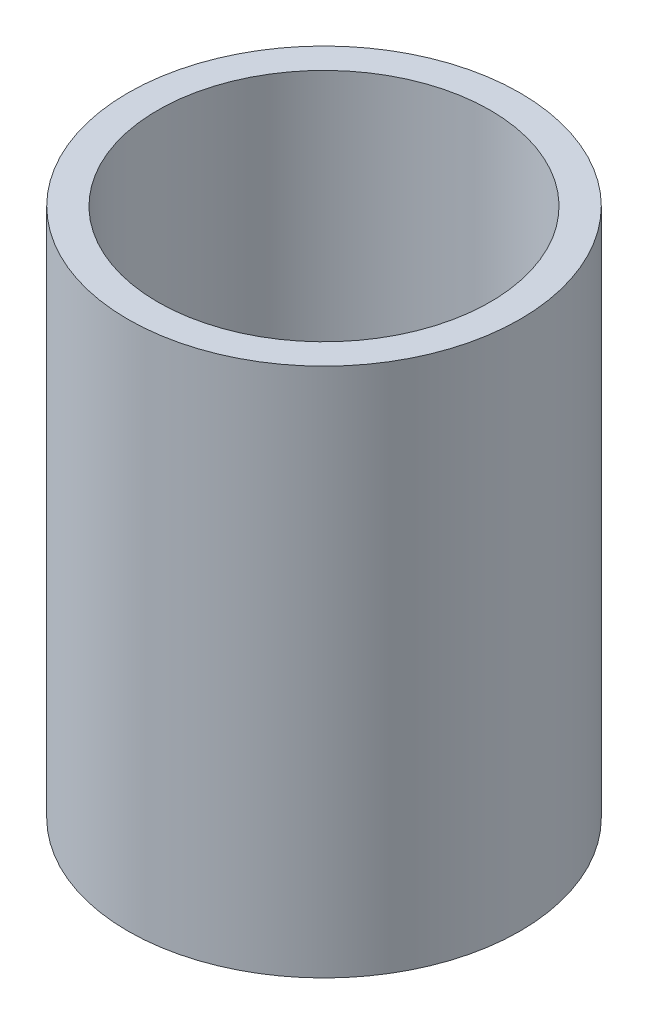
ISO-10303-21;
HEADER;
FILE_DESCRIPTION(('STEP AP214'),'2;1');
FILE_NAME('part.step','',(''),(''),'','','');
FILE_SCHEMA(('AUTOMOTIVE_DESIGN { 1 0 10303 214 1 1 1 1 }'));
ENDSEC;
DATA;
#1=APPLICATION_CONTEXT('core data for automotive mechanical design processes');
#2=APPLICATION_PROTOCOL_DEFINITION('international standard','automotive_design',2000,#1);
#3=PRODUCT_CONTEXT('',#1,'mechanical');
#4=PRODUCT('Part','Part','',(#3));
#5=PRODUCT_RELATED_PRODUCT_CATEGORY('part','',(#4));
#6=PRODUCT_DEFINITION_FORMATION('','',#4);
#7=PRODUCT_DEFINITION_CONTEXT('part definition',#1,'design');
#8=PRODUCT_DEFINITION('design','',#6,#7);
#9=PRODUCT_DEFINITION_SHAPE('','',#8);
#10=(LENGTH_UNIT() NAMED_UNIT(*) SI_UNIT(.MILLI.,.METRE.));
#11=(NAMED_UNIT(*) PLANE_ANGLE_UNIT() SI_UNIT($,.RADIAN.));
#12=(NAMED_UNIT(*) SI_UNIT($,.STERADIAN.) SOLID_ANGLE_UNIT());
#13=UNCERTAINTY_MEASURE_WITH_UNIT(LENGTH_MEASURE(1.E-05),#10,'distance_accuracy_value','');
#14=(GEOMETRIC_REPRESENTATION_CONTEXT(3) GLOBAL_UNCERTAINTY_ASSIGNED_CONTEXT((#13)) GLOBAL_UNIT_ASSIGNED_CONTEXT((#10,
#11,#12)) REPRESENTATION_CONTEXT('',''));
#15=CARTESIAN_POINT('',(0.,0.,0.));
#16=DIRECTION('',(0.,0.,1.));
#17=DIRECTION('',(1.,0.,0.));
#18=AXIS2_PLACEMENT_3D('',#15,#16,#17);
#19=CARTESIAN_POINT('',(0.,94.5751083555246,0.));
#20=DIRECTION('',(0.,-1.,0.));
#21=DIRECTION('',(0.,0.,-1.));
#22=AXIS2_PLACEMENT_3D('',#19,#20,#21);
#23=CYLINDRICAL_SURFACE('',#22,35.);
#24=CARTESIAN_POINT('',(0.,94.5751083555246,0.));
#25=DIRECTION('',(0.,1.,0.));
#26=DIRECTION('',(0.,0.,1.));
#27=AXIS2_PLACEMENT_3D('',#24,#25,#26);
#28=CIRCLE('',#27,35.);
#29=CARTESIAN_POINT('',(0.,94.5751083555246,35.));
#30=VERTEX_POINT('',#29);
#31=EDGE_CURVE('E10',#30,#30,#28,.T.);
#32=ORIENTED_EDGE('',*,*,#31,.F.);
#33=EDGE_LOOP('',(#32));
#34=FACE_BOUND('',#33,.T.);
#35=CARTESIAN_POINT('',(0.,0.,0.));
#36=DIRECTION('',(0.,1.,0.));
#37=DIRECTION('',(0.,0.,1.));
#38=AXIS2_PLACEMENT_3D('',#35,#36,#37);
#39=CIRCLE('',#38,35.);
#40=CARTESIAN_POINT('',(0.,0.,35.));
#41=VERTEX_POINT('',#40);
#42=EDGE_CURVE('E37',#41,#41,#39,.T.);
#43=ORIENTED_EDGE('',*,*,#42,.T.);
#44=EDGE_LOOP('',(#43));
#45=FACE_BOUND('',#44,.T.);
#46=ADVANCED_FACE('F40',(#34,#45),#23,.T.);
#47=CARTESIAN_POINT('',(0.,94.5751083555246,0.));
#48=DIRECTION('',(0.,1.,0.));
#49=DIRECTION('',(0.,0.,1.));
#50=AXIS2_PLACEMENT_3D('',#47,#48,#49);
#51=PLANE('',#50);
#52=CARTESIAN_POINT('',(0.,94.5751083555246,0.));
#53=DIRECTION('',(0.,1.,0.));
#54=DIRECTION('',(0.,0.,1.));
#55=AXIS2_PLACEMENT_3D('',#52,#53,#54);
#56=CIRCLE('',#55,29.6682032258585);
#57=CARTESIAN_POINT('',(0.,94.5751083555246,29.6682032258585));
#58=VERTEX_POINT('',#57);
#59=EDGE_CURVE('E50',#58,#58,#56,.T.);
#60=ORIENTED_EDGE('',*,*,#59,.F.);
#61=EDGE_LOOP('',(#60));
#62=FACE_BOUND('',#61,.T.);
#63=ORIENTED_EDGE('',*,*,#31,.T.);
#64=EDGE_LOOP('',(#63));
#65=FACE_BOUND('',#64,.T.);
#66=ADVANCED_FACE('F59',(#62,#65),#51,.T.);
#67=CARTESIAN_POINT('',(0.,0.,0.));
#68=DIRECTION('',(0.,1.,0.));
#69=DIRECTION('',(0.,0.,1.));
#70=AXIS2_PLACEMENT_3D('',#67,#68,#69);
#71=PLANE('',#70);
#72=CARTESIAN_POINT('',(0.,0.,0.));
#73=DIRECTION('',(0.,1.,0.));
#74=DIRECTION('',(0.,0.,1.));
#75=AXIS2_PLACEMENT_3D('',#72,#73,#74);
#76=CIRCLE('',#75,29.6682032258585);
#77=CARTESIAN_POINT('',(0.,0.,29.6682032258585));
#78=VERTEX_POINT('',#77);
#79=EDGE_CURVE('E47',#78,#78,#76,.T.);
#80=ORIENTED_EDGE('',*,*,#79,.T.);
#81=EDGE_LOOP('',(#80));
#82=FACE_BOUND('',#81,.T.);
#83=ORIENTED_EDGE('',*,*,#42,.F.);
#84=EDGE_LOOP('',(#83));
#85=FACE_BOUND('',#84,.T.);
#86=ADVANCED_FACE('F58',(#82,#85),#71,.F.);
#87=CARTESIAN_POINT('',(0.,94.5751083555246,0.));
#88=DIRECTION('',(0.,-1.,0.));
#89=DIRECTION('',(0.,0.,-1.));
#90=AXIS2_PLACEMENT_3D('',#87,#88,#89);
#91=CYLINDRICAL_SURFACE('',#90,29.6682032258585);
#92=ORIENTED_EDGE('',*,*,#59,.T.);
#93=EDGE_LOOP('',(#92));
#94=FACE_BOUND('',#93,.T.);
#95=ORIENTED_EDGE('',*,*,#79,.F.);
#96=EDGE_LOOP('',(#95));
#97=FACE_BOUND('',#96,.T.);
#98=ADVANCED_FACE('F54',(#94,#97),#91,.F.);
#99=CLOSED_SHELL('',(#46,#66,#86,#98));
#100=MANIFOLD_SOLID_BREP('B2',#99);
#101=ADVANCED_BREP_SHAPE_REPRESENTATION('',(#18,#100),#14);
#102=SHAPE_DEFINITION_REPRESENTATION(#9,#101);
ENDSEC;
END-ISO-10303-21;
